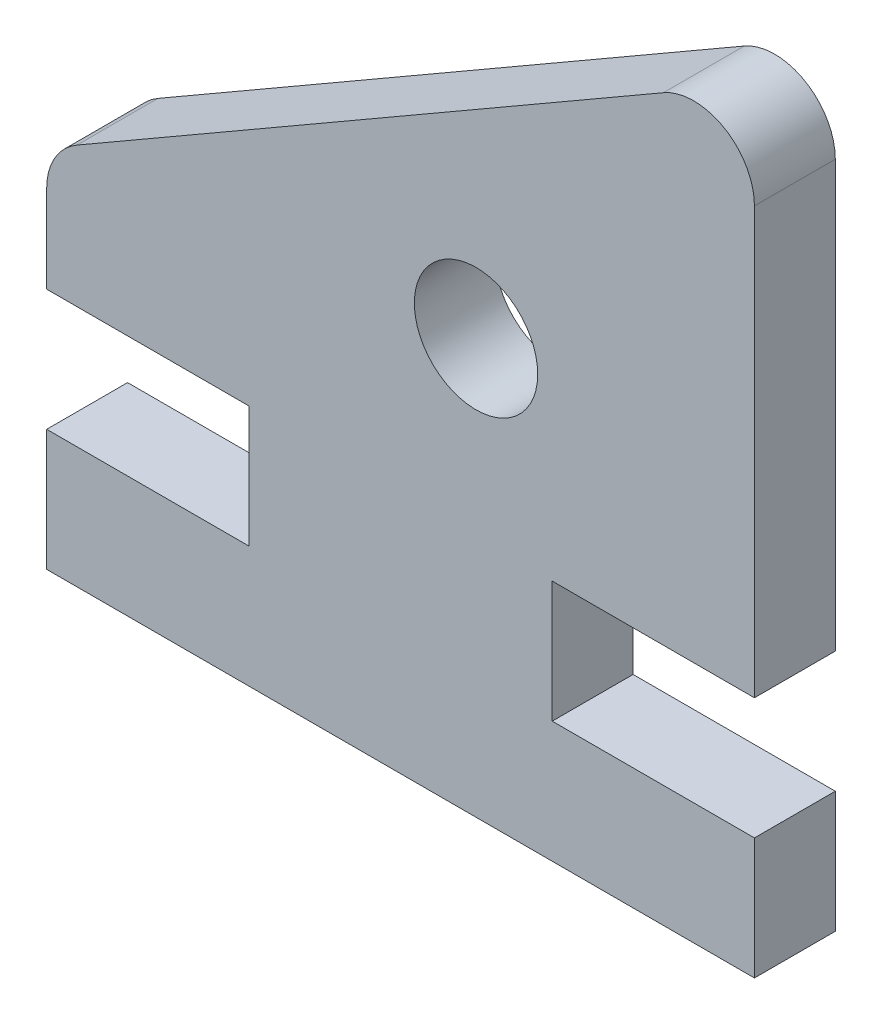
ISO-10303-21;
HEADER;
FILE_DESCRIPTION(('STEP AP214'),'2;1');
FILE_NAME('part.step','',(''),(''),'','','');
FILE_SCHEMA(('AUTOMOTIVE_DESIGN { 1 0 10303 214 1 1 1 1 }'));
ENDSEC;
DATA;
#1=APPLICATION_CONTEXT('core data for automotive mechanical design processes');
#2=APPLICATION_PROTOCOL_DEFINITION('international standard','automotive_design',2000,#1);
#3=PRODUCT_CONTEXT('',#1,'mechanical');
#4=PRODUCT('Part','Part','',(#3));
#5=PRODUCT_RELATED_PRODUCT_CATEGORY('part','',(#4));
#6=PRODUCT_DEFINITION_FORMATION('','',#4);
#7=PRODUCT_DEFINITION_CONTEXT('part definition',#1,'design');
#8=PRODUCT_DEFINITION('design','',#6,#7);
#9=PRODUCT_DEFINITION_SHAPE('','',#8);
#10=(LENGTH_UNIT() NAMED_UNIT(*) SI_UNIT(.MILLI.,.METRE.));
#11=(NAMED_UNIT(*) PLANE_ANGLE_UNIT() SI_UNIT($,.RADIAN.));
#12=(NAMED_UNIT(*) SI_UNIT($,.STERADIAN.) SOLID_ANGLE_UNIT());
#13=UNCERTAINTY_MEASURE_WITH_UNIT(LENGTH_MEASURE(1.E-05),#10,'distance_accuracy_value','');
#14=(GEOMETRIC_REPRESENTATION_CONTEXT(3) GLOBAL_UNCERTAINTY_ASSIGNED_CONTEXT((#13)) GLOBAL_UNIT_ASSIGNED_CONTEXT((#10,
#11,#12)) REPRESENTATION_CONTEXT('',''));
#15=CARTESIAN_POINT('',(0.,0.,0.));
#16=DIRECTION('',(0.,0.,1.));
#17=DIRECTION('',(1.,0.,0.));
#18=AXIS2_PLACEMENT_3D('',#15,#16,#17);
#19=CARTESIAN_POINT('',(0.,6.,4.));
#20=DIRECTION('',(0.,-1.,0.));
#21=DIRECTION('',(1.,0.,0.));
#22=AXIS2_PLACEMENT_3D('',#19,#20,#21);
#23=PLANE('',#22);
#24=DIRECTION('',(-1.,0.,0.));
#25=VECTOR('',#24,1.);
#26=CARTESIAN_POINT('',(0.,6.,0.));
#27=LINE('',#26,#25);
#28=CARTESIAN_POINT('',(0.,6.,0.));
#29=VERTEX_POINT('',#28);
#30=CARTESIAN_POINT('',(-10.,6.,0.));
#31=VERTEX_POINT('',#30);
#32=EDGE_CURVE('E158',#29,#31,#27,.T.);
#33=ORIENTED_EDGE('',*,*,#32,.T.);
#34=DIRECTION('',(0.,0.,-1.));
#35=VECTOR('',#34,1.);
#36=CARTESIAN_POINT('',(-10.,6.,4.));
#37=LINE('',#36,#35);
#38=CARTESIAN_POINT('',(-10.,6.,4.));
#39=VERTEX_POINT('',#38);
#40=EDGE_CURVE('E140',#39,#31,#37,.T.);
#41=ORIENTED_EDGE('',*,*,#40,.F.);
#42=DIRECTION('',(-1.,0.,0.));
#43=VECTOR('',#42,1.);
#44=CARTESIAN_POINT('',(0.,6.,4.));
#45=LINE('',#44,#43);
#46=CARTESIAN_POINT('',(0.,6.,4.));
#47=VERTEX_POINT('',#46);
#48=EDGE_CURVE('E146',#47,#39,#45,.T.);
#49=ORIENTED_EDGE('',*,*,#48,.F.);
#50=DIRECTION('',(0.,0.,-1.));
#51=VECTOR('',#50,1.);
#52=CARTESIAN_POINT('',(0.,6.,4.));
#53=LINE('',#52,#51);
#54=EDGE_CURVE('E225',#47,#29,#53,.T.);
#55=ORIENTED_EDGE('',*,*,#54,.T.);
#56=EDGE_LOOP('',(#33,#41,#49,#55));
#57=FACE_BOUND('',#56,.T.);
#58=ADVANCED_FACE('F34',(#57),#23,.F.);
#59=CARTESIAN_POINT('',(-10.,0.,4.));
#60=DIRECTION('',(-1.,0.,0.));
#61=DIRECTION('',(0.,0.,1.));
#62=AXIS2_PLACEMENT_3D('',#59,#60,#61);
#63=PLANE('',#62);
#64=DIRECTION('',(0.,1.,0.));
#65=VECTOR('',#64,1.);
#66=CARTESIAN_POINT('',(-10.,0.,0.));
#67=LINE('',#66,#65);
#68=CARTESIAN_POINT('',(-10.,12.,0.));
#69=VERTEX_POINT('',#68);
#70=EDGE_CURVE('E245',#31,#69,#67,.T.);
#71=ORIENTED_EDGE('',*,*,#70,.T.);
#72=DIRECTION('',(0.,0.,-1.));
#73=VECTOR('',#72,1.);
#74=CARTESIAN_POINT('',(-10.,12.,4.));
#75=LINE('',#74,#73);
#76=CARTESIAN_POINT('',(-10.,12.,4.));
#77=VERTEX_POINT('',#76);
#78=EDGE_CURVE('E142',#77,#69,#75,.T.);
#79=ORIENTED_EDGE('',*,*,#78,.F.);
#80=DIRECTION('',(0.,1.,0.));
#81=VECTOR('',#80,1.);
#82=CARTESIAN_POINT('',(-10.,0.,4.));
#83=LINE('',#82,#81);
#84=EDGE_CURVE('E135',#39,#77,#83,.T.);
#85=ORIENTED_EDGE('',*,*,#84,.F.);
#86=ORIENTED_EDGE('',*,*,#40,.T.);
#87=EDGE_LOOP('',(#71,#79,#85,#86));
#88=FACE_BOUND('',#87,.T.);
#89=ADVANCED_FACE('F138',(#88),#63,.F.);
#90=CARTESIAN_POINT('',(0.,12.,4.));
#91=DIRECTION('',(0.,-1.,0.));
#92=DIRECTION('',(0.,0.,-1.));
#93=AXIS2_PLACEMENT_3D('',#90,#91,#92);
#94=PLANE('',#93);
#95=DIRECTION('',(-1.,0.,0.));
#96=VECTOR('',#95,1.);
#97=CARTESIAN_POINT('',(0.,12.,0.));
#98=LINE('',#97,#96);
#99=CARTESIAN_POINT('',(0.,12.,0.));
#100=VERTEX_POINT('',#99);
#101=EDGE_CURVE('E210',#100,#69,#98,.T.);
#102=ORIENTED_EDGE('',*,*,#101,.F.);
#103=DIRECTION('',(0.,0.,-1.));
#104=VECTOR('',#103,1.);
#105=CARTESIAN_POINT('',(0.,12.,4.));
#106=LINE('',#105,#104);
#107=CARTESIAN_POINT('',(0.,12.,4.));
#108=VERTEX_POINT('',#107);
#109=EDGE_CURVE('E164',#108,#100,#106,.T.);
#110=ORIENTED_EDGE('',*,*,#109,.F.);
#111=DIRECTION('',(-1.,0.,0.));
#112=VECTOR('',#111,1.);
#113=CARTESIAN_POINT('',(0.,12.,4.));
#114=LINE('',#113,#112);
#115=EDGE_CURVE('E145',#108,#77,#114,.T.);
#116=ORIENTED_EDGE('',*,*,#115,.T.);
#117=ORIENTED_EDGE('',*,*,#78,.T.);
#118=EDGE_LOOP('',(#102,#110,#116,#117));
#119=FACE_BOUND('',#118,.T.);
#120=ADVANCED_FACE('F244',(#119),#94,.T.);
#121=CARTESIAN_POINT('',(0.,0.,4.));
#122=DIRECTION('',(1.,0.,0.));
#123=DIRECTION('',(0.,1.,0.));
#124=AXIS2_PLACEMENT_3D('',#121,#122,#123);
#125=PLANE('',#124);
#126=DIRECTION('',(0.,-1.,0.));
#127=VECTOR('',#126,1.);
#128=CARTESIAN_POINT('',(0.,0.,0.));
#129=LINE('',#128,#127);
#130=CARTESIAN_POINT('',(0.,33.0677313259561,0.));
#131=VERTEX_POINT('',#130);
#132=EDGE_CURVE('E205',#131,#100,#129,.T.);
#133=ORIENTED_EDGE('',*,*,#132,.F.);
#134=DIRECTION('',(0.,0.,-1.));
#135=VECTOR('',#134,1.);
#136=CARTESIAN_POINT('',(0.,33.0677313259561,4.));
#137=LINE('',#136,#135);
#138=CARTESIAN_POINT('',(0.,33.0677313259561,4.));
#139=VERTEX_POINT('',#138);
#140=EDGE_CURVE('E11',#131,#139,#137,.F.);
#141=ORIENTED_EDGE('',*,*,#140,.T.);
#142=DIRECTION('',(0.,-1.,0.));
#143=VECTOR('',#142,1.);
#144=CARTESIAN_POINT('',(0.,0.,4.));
#145=LINE('',#144,#143);
#146=EDGE_CURVE('E241',#139,#108,#145,.T.);
#147=ORIENTED_EDGE('',*,*,#146,.T.);
#148=ORIENTED_EDGE('',*,*,#109,.T.);
#149=EDGE_LOOP('',(#133,#141,#147,#148));
#150=FACE_BOUND('',#149,.T.);
#151=ADVANCED_FACE('F240',(#150),#125,.T.);
#152=CARTESIAN_POINT('',(-16.5687476868981,28.6979128114972,4.));
#153=DIRECTION('',(-0.499999999999995,0.866025403784441,0.));
#154=DIRECTION('',(-0.866025403784442,-0.499999999999995,0.));
#155=AXIS2_PLACEMENT_3D('',#152,#153,#154);
#156=PLANE('',#155);
#157=DIRECTION('',(0.866025403784442,0.499999999999995,0.));
#158=VECTOR('',#157,1.);
#159=CARTESIAN_POINT('',(-16.5687476868981,28.6979128114972,0.));
#160=LINE('',#159,#158);
#161=CARTESIAN_POINT('',(-33.5,18.9226497308105,0.));
#162=VERTEX_POINT('',#161);
#163=CARTESIAN_POINT('',(-4.49999999999999,35.6658075373094,0.));
#164=VERTEX_POINT('',#163);
#165=EDGE_CURVE('E199',#162,#164,#160,.T.);
#166=ORIENTED_EDGE('',*,*,#165,.F.);
#167=DIRECTION('',(0.,0.,-1.));
#168=VECTOR('',#167,1.);
#169=CARTESIAN_POINT('',(-33.5,18.9226497308105,4.));
#170=LINE('',#169,#168);
#171=CARTESIAN_POINT('',(-33.5,18.9226497308105,4.));
#172=VERTEX_POINT('',#171);
#173=EDGE_CURVE('E174',#162,#172,#170,.F.);
#174=ORIENTED_EDGE('',*,*,#173,.T.);
#175=DIRECTION('',(0.866025403784442,0.499999999999995,0.));
#176=VECTOR('',#175,1.);
#177=CARTESIAN_POINT('',(-16.5687476868981,28.6979128114972,4.));
#178=LINE('',#177,#176);
#179=CARTESIAN_POINT('',(-4.49999999999999,35.6658075373094,4.));
#180=VERTEX_POINT('',#179);
#181=EDGE_CURVE('E182',#172,#180,#178,.T.);
#182=ORIENTED_EDGE('',*,*,#181,.T.);
#183=DIRECTION('',(0.,0.,-1.));
#184=VECTOR('',#183,1.);
#185=CARTESIAN_POINT('',(-4.49999999999999,35.6658075373094,4.));
#186=LINE('',#185,#184);
#187=EDGE_CURVE('E171',#180,#164,#186,.T.);
#188=ORIENTED_EDGE('',*,*,#187,.T.);
#189=EDGE_LOOP('',(#166,#174,#182,#188));
#190=FACE_BOUND('',#189,.T.);
#191=ADVANCED_FACE('F203',(#190),#156,.T.);
#192=CARTESIAN_POINT('',(-35.,0.,4.));
#193=DIRECTION('',(-1.,0.,0.));
#194=DIRECTION('',(0.,0.,1.));
#195=AXIS2_PLACEMENT_3D('',#192,#193,#194);
#196=PLANE('',#195);
#197=DIRECTION('',(0.,1.,0.));
#198=VECTOR('',#197,1.);
#199=CARTESIAN_POINT('',(-35.,0.,4.));
#200=LINE('',#199,#198);
#201=CARTESIAN_POINT('',(-35.,12.,4.));
#202=VERTEX_POINT('',#201);
#203=CARTESIAN_POINT('',(-35.,16.3245735194572,4.));
#204=VERTEX_POINT('',#203);
#205=EDGE_CURVE('E180',#202,#204,#200,.T.);
#206=ORIENTED_EDGE('',*,*,#205,.T.);
#207=DIRECTION('',(0.,0.,-1.));
#208=VECTOR('',#207,1.);
#209=CARTESIAN_POINT('',(-35.,16.3245735194572,4.));
#210=LINE('',#209,#208);
#211=CARTESIAN_POINT('',(-35.,16.3245735194572,0.));
#212=VERTEX_POINT('',#211);
#213=EDGE_CURVE('E159',#204,#212,#210,.T.);
#214=ORIENTED_EDGE('',*,*,#213,.T.);
#215=DIRECTION('',(0.,1.,0.));
#216=VECTOR('',#215,1.);
#217=CARTESIAN_POINT('',(-35.,0.,0.));
#218=LINE('',#217,#216);
#219=CARTESIAN_POINT('',(-35.,12.,0.));
#220=VERTEX_POINT('',#219);
#221=EDGE_CURVE('E201',#220,#212,#218,.T.);
#222=ORIENTED_EDGE('',*,*,#221,.F.);
#223=DIRECTION('',(0.,0.,-1.));
#224=VECTOR('',#223,1.);
#225=CARTESIAN_POINT('',(-35.,12.,4.));
#226=LINE('',#225,#224);
#227=EDGE_CURVE('E190',#202,#220,#226,.T.);
#228=ORIENTED_EDGE('',*,*,#227,.F.);
#229=EDGE_LOOP('',(#206,#214,#222,#228));
#230=FACE_BOUND('',#229,.T.);
#231=ADVANCED_FACE('F187',(#230),#196,.T.);
#232=CARTESIAN_POINT('',(0.,12.,4.));
#233=DIRECTION('',(0.,-1.,0.));
#234=DIRECTION('',(0.,0.,-1.));
#235=AXIS2_PLACEMENT_3D('',#232,#233,#234);
#236=PLANE('',#235);
#237=DIRECTION('',(-1.,0.,0.));
#238=VECTOR('',#237,1.);
#239=CARTESIAN_POINT('',(0.,12.,0.));
#240=LINE('',#239,#238);
#241=CARTESIAN_POINT('',(-25.,12.,0.));
#242=VERTEX_POINT('',#241);
#243=EDGE_CURVE('E207',#242,#220,#240,.T.);
#244=ORIENTED_EDGE('',*,*,#243,.F.);
#245=DIRECTION('',(0.,0.,-1.));
#246=VECTOR('',#245,1.);
#247=CARTESIAN_POINT('',(-25.,12.,4.));
#248=LINE('',#247,#246);
#249=CARTESIAN_POINT('',(-25.,12.,4.));
#250=VERTEX_POINT('',#249);
#251=EDGE_CURVE('E235',#250,#242,#248,.T.);
#252=ORIENTED_EDGE('',*,*,#251,.F.);
#253=DIRECTION('',(-1.,0.,0.));
#254=VECTOR('',#253,1.);
#255=CARTESIAN_POINT('',(0.,12.,4.));
#256=LINE('',#255,#254);
#257=EDGE_CURVE('E191',#250,#202,#256,.T.);
#258=ORIENTED_EDGE('',*,*,#257,.T.);
#259=ORIENTED_EDGE('',*,*,#227,.T.);
#260=EDGE_LOOP('',(#244,#252,#258,#259));
#261=FACE_BOUND('',#260,.T.);
#262=ADVANCED_FACE('F290',(#261),#236,.T.);
#263=CARTESIAN_POINT('',(-25.,0.,4.));
#264=DIRECTION('',(-1.,0.,0.));
#265=DIRECTION('',(0.,0.,1.));
#266=AXIS2_PLACEMENT_3D('',#263,#264,#265);
#267=PLANE('',#266);
#268=DIRECTION('',(0.,1.,0.));
#269=VECTOR('',#268,1.);
#270=CARTESIAN_POINT('',(-25.,0.,0.));
#271=LINE('',#270,#269);
#272=CARTESIAN_POINT('',(-25.,6.,0.));
#273=VERTEX_POINT('',#272);
#274=EDGE_CURVE('E216',#273,#242,#271,.T.);
#275=ORIENTED_EDGE('',*,*,#274,.F.);
#276=DIRECTION('',(0.,0.,-1.));
#277=VECTOR('',#276,1.);
#278=CARTESIAN_POINT('',(-25.,6.,4.));
#279=LINE('',#278,#277);
#280=CARTESIAN_POINT('',(-25.,6.,4.));
#281=VERTEX_POINT('',#280);
#282=EDGE_CURVE('E233',#281,#273,#279,.T.);
#283=ORIENTED_EDGE('',*,*,#282,.F.);
#284=DIRECTION('',(0.,1.,0.));
#285=VECTOR('',#284,1.);
#286=CARTESIAN_POINT('',(-25.,0.,4.));
#287=LINE('',#286,#285);
#288=EDGE_CURVE('E257',#281,#250,#287,.T.);
#289=ORIENTED_EDGE('',*,*,#288,.T.);
#290=ORIENTED_EDGE('',*,*,#251,.T.);
#291=EDGE_LOOP('',(#275,#283,#289,#290));
#292=FACE_BOUND('',#291,.T.);
#293=ADVANCED_FACE('F285',(#292),#267,.T.);
#294=CARTESIAN_POINT('',(0.,6.00000000000001,4.));
#295=DIRECTION('',(0.,-1.,0.));
#296=DIRECTION('',(1.,0.,0.));
#297=AXIS2_PLACEMENT_3D('',#294,#295,#296);
#298=PLANE('',#297);
#299=DIRECTION('',(-1.,0.,0.));
#300=VECTOR('',#299,1.);
#301=CARTESIAN_POINT('',(0.,6.00000000000001,0.));
#302=LINE('',#301,#300);
#303=CARTESIAN_POINT('',(-35.,6.,0.));
#304=VERTEX_POINT('',#303);
#305=EDGE_CURVE('E219',#273,#304,#302,.T.);
#306=ORIENTED_EDGE('',*,*,#305,.T.);
#307=DIRECTION('',(0.,0.,-1.));
#308=VECTOR('',#307,1.);
#309=CARTESIAN_POINT('',(-35.,6.,4.));
#310=LINE('',#309,#308);
#311=CARTESIAN_POINT('',(-35.,6.,4.));
#312=VERTEX_POINT('',#311);
#313=EDGE_CURVE('E231',#312,#304,#310,.T.);
#314=ORIENTED_EDGE('',*,*,#313,.F.);
#315=DIRECTION('',(-1.,0.,0.));
#316=VECTOR('',#315,1.);
#317=CARTESIAN_POINT('',(0.,6.00000000000001,4.));
#318=LINE('',#317,#316);
#319=EDGE_CURVE('E255',#281,#312,#318,.T.);
#320=ORIENTED_EDGE('',*,*,#319,.F.);
#321=ORIENTED_EDGE('',*,*,#282,.T.);
#322=EDGE_LOOP('',(#306,#314,#320,#321));
#323=FACE_BOUND('',#322,.T.);
#324=ADVANCED_FACE('F291',(#323),#298,.F.);
#325=CARTESIAN_POINT('',(-35.,0.,0.));
#326=VERTEX_POINT('',#325);
#327=EDGE_CURVE('E209',#326,#304,#218,.T.);
#328=ORIENTED_EDGE('',*,*,#327,.F.);
#329=DIRECTION('',(0.,0.,-1.));
#330=VECTOR('',#329,1.);
#331=CARTESIAN_POINT('',(-35.,0.,4.));
#332=LINE('',#331,#330);
#333=CARTESIAN_POINT('',(-35.,0.,4.));
#334=VERTEX_POINT('',#333);
#335=EDGE_CURVE('E229',#334,#326,#332,.T.);
#336=ORIENTED_EDGE('',*,*,#335,.F.);
#337=EDGE_CURVE('E193',#334,#312,#200,.T.);
#338=ORIENTED_EDGE('',*,*,#337,.T.);
#339=ORIENTED_EDGE('',*,*,#313,.T.);
#340=EDGE_LOOP('',(#328,#336,#338,#339));
#341=FACE_BOUND('',#340,.T.);
#342=ADVANCED_FACE('F279',(#341),#196,.T.);
#343=CARTESIAN_POINT('',(0.,0.,4.));
#344=DIRECTION('',(0.,-1.,0.));
#345=DIRECTION('',(1.,0.,0.));
#346=AXIS2_PLACEMENT_3D('',#343,#344,#345);
#347=PLANE('',#346);
#348=DIRECTION('',(-1.,0.,0.));
#349=VECTOR('',#348,1.);
#350=CARTESIAN_POINT('',(0.,0.,0.));
#351=LINE('',#350,#349);
#352=CARTESIAN_POINT('',(0.,0.,0.));
#353=VERTEX_POINT('',#352);
#354=EDGE_CURVE('E222',#353,#326,#351,.T.);
#355=ORIENTED_EDGE('',*,*,#354,.F.);
#356=DIRECTION('',(0.,0.,-1.));
#357=VECTOR('',#356,1.);
#358=CARTESIAN_POINT('',(0.,0.,4.));
#359=LINE('',#358,#357);
#360=CARTESIAN_POINT('',(0.,0.,4.));
#361=VERTEX_POINT('',#360);
#362=EDGE_CURVE('E227',#361,#353,#359,.T.);
#363=ORIENTED_EDGE('',*,*,#362,.F.);
#364=DIRECTION('',(-1.,0.,0.));
#365=VECTOR('',#364,1.);
#366=CARTESIAN_POINT('',(0.,0.,4.));
#367=LINE('',#366,#365);
#368=EDGE_CURVE('E252',#361,#334,#367,.T.);
#369=ORIENTED_EDGE('',*,*,#368,.T.);
#370=ORIENTED_EDGE('',*,*,#335,.T.);
#371=EDGE_LOOP('',(#355,#363,#369,#370));
#372=FACE_BOUND('',#371,.T.);
#373=ADVANCED_FACE('F274',(#372),#347,.T.);
#374=CARTESIAN_POINT('',(-13.7679491924311,20.5,4.));
#375=DIRECTION('',(0.,0.,-1.));
#376=DIRECTION('',(-1.,0.,0.));
#377=AXIS2_PLACEMENT_3D('',#374,#375,#376);
#378=CYLINDRICAL_SURFACE('',#377,3.04999999999999);
#379=CARTESIAN_POINT('',(-13.7679491924311,20.5,4.));
#380=DIRECTION('',(0.,0.,1.));
#381=DIRECTION('',(1.,0.,0.));
#382=AXIS2_PLACEMENT_3D('',#379,#380,#381);
#383=CIRCLE('',#382,3.04999999999999);
#384=CARTESIAN_POINT('',(-10.7179491924311,20.5,4.));
#385=VERTEX_POINT('',#384);
#386=EDGE_CURVE('E155',#385,#385,#383,.T.);
#387=ORIENTED_EDGE('',*,*,#386,.T.);
#388=EDGE_LOOP('',(#387));
#389=FACE_BOUND('',#388,.T.);
#390=CARTESIAN_POINT('',(-13.7679491924311,20.5,0.));
#391=DIRECTION('',(0.,0.,1.));
#392=DIRECTION('',(1.,0.,0.));
#393=AXIS2_PLACEMENT_3D('',#390,#391,#392);
#394=CIRCLE('',#393,3.04999999999999);
#395=CARTESIAN_POINT('',(-10.7179491924311,20.5,0.));
#396=VERTEX_POINT('',#395);
#397=EDGE_CURVE('E249',#396,#396,#394,.T.);
#398=ORIENTED_EDGE('',*,*,#397,.F.);
#399=EDGE_LOOP('',(#398));
#400=FACE_BOUND('',#399,.T.);
#401=ADVANCED_FACE('F308',(#389,#400),#378,.F.);
#402=EDGE_CURVE('E212',#29,#353,#129,.T.);
#403=ORIENTED_EDGE('',*,*,#402,.F.);
#404=ORIENTED_EDGE('',*,*,#54,.F.);
#405=EDGE_CURVE('E153',#47,#361,#145,.T.);
#406=ORIENTED_EDGE('',*,*,#405,.T.);
#407=ORIENTED_EDGE('',*,*,#362,.T.);
#408=EDGE_LOOP('',(#403,#404,#406,#407));
#409=FACE_BOUND('',#408,.T.);
#410=ADVANCED_FACE('F272',(#409),#125,.T.);
#411=CARTESIAN_POINT('',(0.,0.,4.));
#412=DIRECTION('',(0.,0.,1.));
#413=DIRECTION('',(1.,0.,0.));
#414=AXIS2_PLACEMENT_3D('',#411,#412,#413);
#415=PLANE('',#414);
#416=ORIENTED_EDGE('',*,*,#386,.F.);
#417=EDGE_LOOP('',(#416));
#418=FACE_BOUND('',#417,.T.);
#419=ORIENTED_EDGE('',*,*,#181,.F.);
#420=CARTESIAN_POINT('',(-32.,16.3245735194572,4.));
#421=DIRECTION('',(0.,0.,1.));
#422=DIRECTION('',(1.,0.,0.));
#423=AXIS2_PLACEMENT_3D('',#420,#421,#422);
#424=CIRCLE('',#423,3.);
#425=EDGE_CURVE('E42',#172,#204,#424,.T.);
#426=ORIENTED_EDGE('',*,*,#425,.T.);
#427=ORIENTED_EDGE('',*,*,#205,.F.);
#428=ORIENTED_EDGE('',*,*,#257,.F.);
#429=ORIENTED_EDGE('',*,*,#288,.F.);
#430=ORIENTED_EDGE('',*,*,#319,.T.);
#431=ORIENTED_EDGE('',*,*,#337,.F.);
#432=ORIENTED_EDGE('',*,*,#368,.F.);
#433=ORIENTED_EDGE('',*,*,#405,.F.);
#434=ORIENTED_EDGE('',*,*,#48,.T.);
#435=ORIENTED_EDGE('',*,*,#84,.T.);
#436=ORIENTED_EDGE('',*,*,#115,.F.);
#437=ORIENTED_EDGE('',*,*,#146,.F.);
#438=CARTESIAN_POINT('',(-3.00000000000001,33.0677313259561,4.));
#439=DIRECTION('',(0.,0.,1.));
#440=DIRECTION('',(1.,0.,0.));
#441=AXIS2_PLACEMENT_3D('',#438,#439,#440);
#442=CIRCLE('',#441,3.);
#443=EDGE_CURVE('E54',#139,#180,#442,.T.);
#444=ORIENTED_EDGE('',*,*,#443,.T.);
#445=EDGE_LOOP('',(#419,#426,#427,#428,#429,#430,#431,#432,#433,#434,#435,#436,#437,#444));
#446=FACE_BOUND('',#445,.T.);
#447=ADVANCED_FACE('F150',(#418,#446),#415,.T.);
#448=CARTESIAN_POINT('',(0.,0.,0.));
#449=DIRECTION('',(0.,0.,1.));
#450=DIRECTION('',(1.,0.,0.));
#451=AXIS2_PLACEMENT_3D('',#448,#449,#450);
#452=PLANE('',#451);
#453=ORIENTED_EDGE('',*,*,#397,.T.);
#454=EDGE_LOOP('',(#453));
#455=FACE_BOUND('',#454,.T.);
#456=ORIENTED_EDGE('',*,*,#221,.T.);
#457=CARTESIAN_POINT('',(-32.,16.3245735194572,0.));
#458=DIRECTION('',(0.,0.,1.));
#459=DIRECTION('',(1.,0.,0.));
#460=AXIS2_PLACEMENT_3D('',#457,#458,#459);
#461=CIRCLE('',#460,3.);
#462=EDGE_CURVE('E169',#212,#162,#461,.F.);
#463=ORIENTED_EDGE('',*,*,#462,.T.);
#464=ORIENTED_EDGE('',*,*,#165,.T.);
#465=CARTESIAN_POINT('',(-3.00000000000001,33.0677313259561,0.));
#466=DIRECTION('',(0.,0.,1.));
#467=DIRECTION('',(1.,0.,0.));
#468=AXIS2_PLACEMENT_3D('',#465,#466,#467);
#469=CIRCLE('',#468,3.);
#470=EDGE_CURVE('E162',#164,#131,#469,.F.);
#471=ORIENTED_EDGE('',*,*,#470,.T.);
#472=ORIENTED_EDGE('',*,*,#132,.T.);
#473=ORIENTED_EDGE('',*,*,#101,.T.);
#474=ORIENTED_EDGE('',*,*,#70,.F.);
#475=ORIENTED_EDGE('',*,*,#32,.F.);
#476=ORIENTED_EDGE('',*,*,#402,.T.);
#477=ORIENTED_EDGE('',*,*,#354,.T.);
#478=ORIENTED_EDGE('',*,*,#327,.T.);
#479=ORIENTED_EDGE('',*,*,#305,.F.);
#480=ORIENTED_EDGE('',*,*,#274,.T.);
#481=ORIENTED_EDGE('',*,*,#243,.T.);
#482=EDGE_LOOP('',(#456,#463,#464,#471,#472,#473,#474,#475,#476,#477,#478,#479,#480,#481));
#483=FACE_BOUND('',#482,.T.);
#484=ADVANCED_FACE('F198',(#455,#483),#452,.F.);
#485=CARTESIAN_POINT('',(-32.,16.3245735194572,4.));
#486=DIRECTION('',(0.,0.,-1.));
#487=DIRECTION('',(-1.,0.,0.));
#488=AXIS2_PLACEMENT_3D('',#485,#486,#487);
#489=CYLINDRICAL_SURFACE('',#488,3.);
#490=ORIENTED_EDGE('',*,*,#425,.F.);
#491=ORIENTED_EDGE('',*,*,#173,.F.);
#492=ORIENTED_EDGE('',*,*,#462,.F.);
#493=ORIENTED_EDGE('',*,*,#213,.F.);
#494=EDGE_LOOP('',(#490,#491,#492,#493));
#495=FACE_BOUND('',#494,.T.);
#496=ADVANCED_FACE('F194',(#495),#489,.T.);
#497=CARTESIAN_POINT('',(-3.00000000000001,33.0677313259561,4.));
#498=DIRECTION('',(0.,0.,-1.));
#499=DIRECTION('',(-1.,0.,0.));
#500=AXIS2_PLACEMENT_3D('',#497,#498,#499);
#501=CYLINDRICAL_SURFACE('',#500,3.);
#502=ORIENTED_EDGE('',*,*,#443,.F.);
#503=ORIENTED_EDGE('',*,*,#140,.F.);
#504=ORIENTED_EDGE('',*,*,#470,.F.);
#505=ORIENTED_EDGE('',*,*,#187,.F.);
#506=EDGE_LOOP('',(#502,#503,#504,#505));
#507=FACE_BOUND('',#506,.T.);
#508=ADVANCED_FACE('F36',(#507),#501,.T.);
#509=CLOSED_SHELL('',(#58,#89,#120,#151,#191,#231,#262,#293,#324,#342,#373,#401,#410,#447,#484,
#496,#508));
#510=MANIFOLD_SOLID_BREP('B2',#509);
#511=ADVANCED_BREP_SHAPE_REPRESENTATION('',(#18,#510),#14);
#512=SHAPE_DEFINITION_REPRESENTATION(#9,#511);
ENDSEC;
END-ISO-10303-21;
